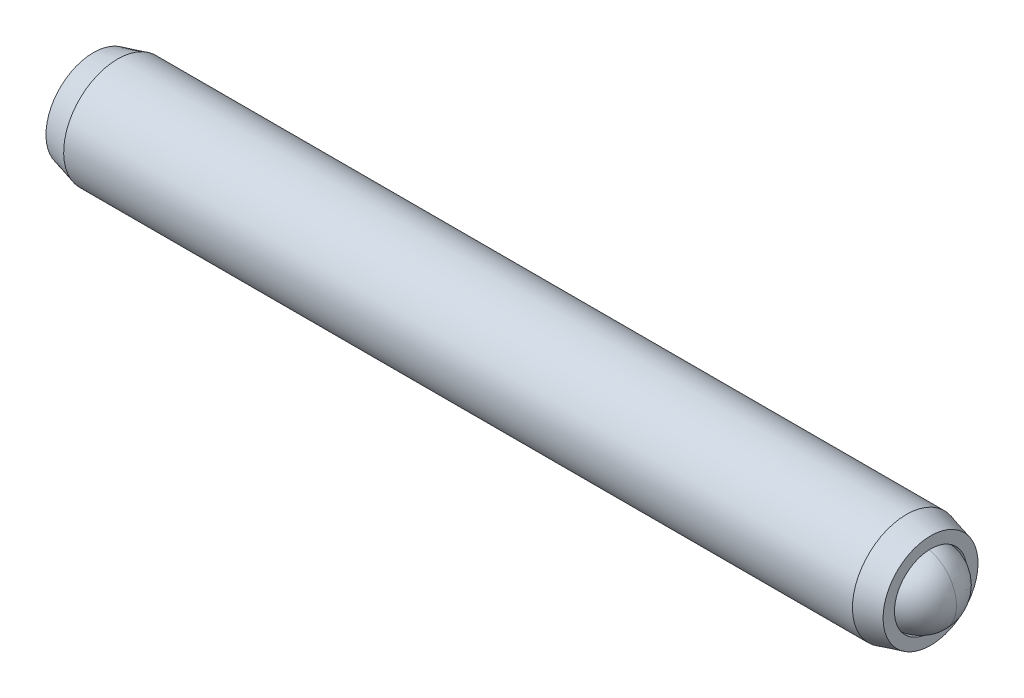
ISO-10303-21;
HEADER;
FILE_DESCRIPTION(('STEP AP214'),'2;1');
FILE_NAME('part.step','',(''),(''),'','','');
FILE_SCHEMA(('AUTOMOTIVE_DESIGN { 1 0 10303 214 1 1 1 1 }'));
ENDSEC;
DATA;
#1=APPLICATION_CONTEXT('core data for automotive mechanical design processes');
#2=APPLICATION_PROTOCOL_DEFINITION('international standard','automotive_design',2000,#1);
#3=PRODUCT_CONTEXT('',#1,'mechanical');
#4=PRODUCT('Part','Part','',(#3));
#5=PRODUCT_RELATED_PRODUCT_CATEGORY('part','',(#4));
#6=PRODUCT_DEFINITION_FORMATION('','',#4);
#7=PRODUCT_DEFINITION_CONTEXT('part definition',#1,'design');
#8=PRODUCT_DEFINITION('design','',#6,#7);
#9=PRODUCT_DEFINITION_SHAPE('','',#8);
#10=(LENGTH_UNIT() NAMED_UNIT(*) SI_UNIT(.MILLI.,.METRE.));
#11=(NAMED_UNIT(*) PLANE_ANGLE_UNIT() SI_UNIT($,.RADIAN.));
#12=(NAMED_UNIT(*) SI_UNIT($,.STERADIAN.) SOLID_ANGLE_UNIT());
#13=UNCERTAINTY_MEASURE_WITH_UNIT(LENGTH_MEASURE(1.E-05),#10,'distance_accuracy_value','');
#14=(GEOMETRIC_REPRESENTATION_CONTEXT(3) GLOBAL_UNCERTAINTY_ASSIGNED_CONTEXT((#13)) GLOBAL_UNIT_ASSIGNED_CONTEXT((#10,
#11,#12)) REPRESENTATION_CONTEXT('',''));
#15=CARTESIAN_POINT('',(0.,0.,0.));
#16=DIRECTION('',(0.,0.,1.));
#17=DIRECTION('',(1.,0.,0.));
#18=AXIS2_PLACEMENT_3D('',#15,#16,#17);
#19=CARTESIAN_POINT('',(-35.5952580819999,9.11150092372431,3.86220416332089));
#20=DIRECTION('',(-1.,0.,0.));
#21=DIRECTION('',(0.,-1.,0.));
#22=AXIS2_PLACEMENT_3D('',#19,#20,#21);
#23=PLANE('',#22);
#24=DIRECTION('',(0.,0.866025403784439,-0.5));
#25=VECTOR('',#24,1.);
#26=CARTESIAN_POINT('',(-35.5952580819999,8.9845009237243,2.49655427033648));
#27=LINE('',#26,#25);
#28=CARTESIAN_POINT('',(-35.5952580819999,7.8653134237243,3.14271747473515));
#29=VERTEX_POINT('',#28);
#30=CARTESIAN_POINT('',(-35.5952580819999,9.1115009237243,2.4232307861494));
#31=VERTEX_POINT('',#30);
#32=EDGE_CURVE('P0_E163',#29,#31,#27,.T.);
#33=ORIENTED_EDGE('',*,*,#32,.T.);
#34=DIRECTION('',(0.,0.866025403784439,0.5));
#35=VECTOR('',#34,1.);
#36=CARTESIAN_POINT('',(-35.5952580819999,10.2306884237243,3.06939399054806));
#37=LINE('',#36,#35);
#38=CARTESIAN_POINT('',(-35.5952580819999,10.3576884237243,3.14271747473515));
#39=VERTEX_POINT('',#38);
#40=EDGE_CURVE('P0_E165',#31,#39,#37,.T.);
#41=ORIENTED_EDGE('',*,*,#40,.T.);
#42=DIRECTION('',(0.,0.,1.));
#43=VECTOR('',#42,1.);
#44=CARTESIAN_POINT('',(-35.5952580819999,10.3576884237243,4.43504388353248));
#45=LINE('',#44,#43);
#46=CARTESIAN_POINT('',(-35.5952580819999,10.3576884237243,4.58169085190664));
#47=VERTEX_POINT('',#46);
#48=EDGE_CURVE('P0_E155',#39,#47,#45,.T.);
#49=ORIENTED_EDGE('',*,*,#48,.T.);
#50=DIRECTION('',(0.,-0.866025403784439,0.5));
#51=VECTOR('',#50,1.);
#52=CARTESIAN_POINT('',(-35.5952580819999,9.2385009237243,5.22785405630531));
#53=LINE('',#52,#51);
#54=CARTESIAN_POINT('',(-35.5952580819999,9.1115009237243,5.30117754049239));
#55=VERTEX_POINT('',#54);
#56=EDGE_CURVE('P0_E157',#47,#55,#53,.T.);
#57=ORIENTED_EDGE('',*,*,#56,.T.);
#58=DIRECTION('',(0.,-0.866025403784439,-0.5));
#59=VECTOR('',#58,1.);
#60=CARTESIAN_POINT('',(-35.5952580819999,7.9923134237243,4.65501433609372));
#61=LINE('',#60,#59);
#62=CARTESIAN_POINT('',(-35.5952580819999,7.8653134237243,4.58169085190664));
#63=VERTEX_POINT('',#62);
#64=EDGE_CURVE('P0_E159',#55,#63,#61,.T.);
#65=ORIENTED_EDGE('',*,*,#64,.T.);
#66=DIRECTION('',(0.,0.,-1.));
#67=VECTOR('',#66,1.);
#68=CARTESIAN_POINT('',(-35.5952580819999,7.8653134237243,3.28936444310931));
#69=LINE('',#68,#67);
#70=EDGE_CURVE('P0_E161',#63,#29,#69,.T.);
#71=ORIENTED_EDGE('',*,*,#70,.T.);
#72=EDGE_LOOP('',(#33,#41,#49,#57,#65,#71));
#73=FACE_BOUND('',#72,.T.);
#74=CARTESIAN_POINT('',(-35.5952580819999,9.11150092372431,3.86220416332089));
#75=DIRECTION('',(1.,0.,0.));
#76=DIRECTION('',(0.,1.,0.));
#77=AXIS2_PLACEMENT_3D('',#74,#75,#76);
#78=CIRCLE('',#77,2.0955);
#79=CARTESIAN_POINT('',(-35.5952580819999,11.2070009237243,3.86220416332089));
#80=VERTEX_POINT('',#79);
#81=EDGE_CURVE('P0_E149',#80,#80,#78,.T.);
#82=ORIENTED_EDGE('',*,*,#81,.F.);
#83=EDGE_LOOP('',(#82));
#84=FACE_BOUND('',#83,.T.);
#85=ADVANCED_FACE('P0_F16',(#73,#84),#23,.T.);
#86=CARTESIAN_POINT('',(-34.5288245637371,9.11150092372431,3.86220416332089));
#87=DIRECTION('',(1.,0.,0.));
#88=DIRECTION('',(0.,1.,0.));
#89=AXIS2_PLACEMENT_3D('',#86,#87,#88);
#90=CONICAL_SURFACE('',#89,2.38125,0.261799387799149);
#91=ORIENTED_EDGE('',*,*,#81,.T.);
#92=EDGE_LOOP('',(#91));
#93=FACE_BOUND('',#92,.T.);
#94=CARTESIAN_POINT('',(-34.5288245637371,9.11150092372431,3.86220416332089));
#95=DIRECTION('',(1.,0.,0.));
#96=DIRECTION('',(0.,1.,0.));
#97=AXIS2_PLACEMENT_3D('',#94,#95,#96);
#98=CIRCLE('',#97,2.38125);
#99=CARTESIAN_POINT('',(-34.5288245637371,11.4927509237243,3.86220416332089));
#100=VERTEX_POINT('',#99);
#101=EDGE_CURVE('P0_E146',#100,#100,#98,.T.);
#102=ORIENTED_EDGE('',*,*,#101,.F.);
#103=EDGE_LOOP('',(#102));
#104=FACE_BOUND('',#103,.T.);
#105=ADVANCED_FACE('P0_F224',(#93,#104),#90,.T.);
#106=CARTESIAN_POINT('',(-1.32782211226718,9.11150092372431,3.86220416332089));
#107=DIRECTION('',(1.,0.,0.));
#108=DIRECTION('',(0.,1.,0.));
#109=AXIS2_PLACEMENT_3D('',#106,#107,#108);
#110=CYLINDRICAL_SURFACE('',#109,2.38125);
#111=ORIENTED_EDGE('',*,*,#101,.T.);
#112=EDGE_LOOP('',(#111));
#113=FACE_BOUND('',#112,.T.);
#114=CARTESIAN_POINT('',(0.2953083997373,9.11150092372431,3.86220416332089));
#115=DIRECTION('',(1.,0.,0.));
#116=DIRECTION('',(0.,1.,0.));
#117=AXIS2_PLACEMENT_3D('',#114,#115,#116);
#118=CIRCLE('',#117,2.38125);
#119=CARTESIAN_POINT('',(0.2953083997373,11.4927509237243,3.86220416332089));
#120=VERTEX_POINT('',#119);
#121=EDGE_CURVE('P0_E143',#120,#120,#118,.T.);
#122=ORIENTED_EDGE('',*,*,#121,.F.);
#123=EDGE_LOOP('',(#122));
#124=FACE_BOUND('',#123,.T.);
#125=ADVANCED_FACE('P0_F230',(#113,#124),#110,.T.);
#126=CARTESIAN_POINT('',(1.3617419180001,9.11150092372431,3.86220416332089));
#127=DIRECTION('',(-1.,0.,0.));
#128=DIRECTION('',(0.,-1.,0.));
#129=AXIS2_PLACEMENT_3D('',#126,#127,#128);
#130=CONICAL_SURFACE('',#129,2.0955,0.26179938779915);
#131=ORIENTED_EDGE('',*,*,#121,.T.);
#132=EDGE_LOOP('',(#131));
#133=FACE_BOUND('',#132,.T.);
#134=CARTESIAN_POINT('',(1.3617419180001,9.11150092372431,3.86220416332089));
#135=DIRECTION('',(1.,0.,0.));
#136=DIRECTION('',(0.,1.,0.));
#137=AXIS2_PLACEMENT_3D('',#134,#135,#136);
#138=CIRCLE('',#137,2.0955);
#139=CARTESIAN_POINT('',(1.3617419180001,11.2070009237243,3.86220416332089));
#140=VERTEX_POINT('',#139);
#141=EDGE_CURVE('P0_E140',#140,#140,#138,.T.);
#142=ORIENTED_EDGE('',*,*,#141,.F.);
#143=EDGE_LOOP('',(#142));
#144=FACE_BOUND('',#143,.T.);
#145=ADVANCED_FACE('P0_F274',(#133,#144),#130,.T.);
#146=CARTESIAN_POINT('',(1.3617419180001,11.2070009237243,3.86220416332089));
#147=DIRECTION('',(1.,0.,0.));
#148=DIRECTION('',(0.,1.,0.));
#149=AXIS2_PLACEMENT_3D('',#146,#147,#148);
#150=PLANE('',#149);
#151=ORIENTED_EDGE('',*,*,#141,.T.);
#152=EDGE_LOOP('',(#151));
#153=FACE_BOUND('',#152,.T.);
#154=CARTESIAN_POINT('',(1.3617419180001,9.11150092372431,3.86220416332089));
#155=DIRECTION('',(1.,0.,0.));
#156=DIRECTION('',(0.,1.,0.));
#157=AXIS2_PLACEMENT_3D('',#154,#155,#156);
#158=CIRCLE('',#157,1.59385);
#159=CARTESIAN_POINT('',(1.3617419180001,10.7053509237243,3.86220416332089));
#160=VERTEX_POINT('',#159);
#161=EDGE_CURVE('P0_E137',#160,#160,#158,.T.);
#162=ORIENTED_EDGE('',*,*,#161,.F.);
#163=EDGE_LOOP('',(#162));
#164=FACE_BOUND('',#163,.T.);
#165=ADVANCED_FACE('P0_F270',(#153,#164),#150,.T.);
#166=CARTESIAN_POINT('',(-1.32782211226718,9.11150092372431,3.86220416332089));
#167=DIRECTION('',(1.,0.,0.));
#168=DIRECTION('',(0.,1.,0.));
#169=AXIS2_PLACEMENT_3D('',#166,#167,#168);
#170=CYLINDRICAL_SURFACE('',#169,1.59385);
#171=ORIENTED_EDGE('',*,*,#161,.T.);
#172=EDGE_LOOP('',(#171));
#173=FACE_BOUND('',#172,.T.);
#174=CARTESIAN_POINT('',(0.266027887732813,9.11150092372431,3.86220416332089));
#175=DIRECTION('',(1.,0.,0.));
#176=DIRECTION('',(0.,1.,0.));
#177=AXIS2_PLACEMENT_3D('',#174,#175,#176);
#178=CIRCLE('',#177,1.59385);
#179=CARTESIAN_POINT('',(0.266027887732813,10.7053509237243,3.86220416332089));
#180=VERTEX_POINT('',#179);
#181=EDGE_CURVE('P0_E125',#180,#180,#178,.T.);
#182=ORIENTED_EDGE('',*,*,#181,.F.);
#183=EDGE_LOOP('',(#182));
#184=FACE_BOUND('',#183,.T.);
#185=ADVANCED_FACE('P0_F266',(#173,#184),#170,.F.);
#186=CARTESIAN_POINT('',(-1.32782211226718,9.11150092372431,3.86220416332089));
#187=DIRECTION('',(1.,0.,0.));
#188=DIRECTION('',(0.,1.,0.));
#189=AXIS2_PLACEMENT_3D('',#186,#187,#188);
#190=CONICAL_SURFACE('',#189,0.,0.78539816339745);
#191=ORIENTED_EDGE('',*,*,#181,.T.);
#192=EDGE_LOOP('',(#191));
#193=FACE_BOUND('',#192,.T.);
#194=CARTESIAN_POINT('',(-1.32782211226718,9.11150092372431,3.86220416332089));
#195=VERTEX_POINT('',#194);
#196=VERTEX_LOOP('',#195);
#197=FACE_BOUND('',#196,.T.);
#198=ADVANCED_FACE('P0_F220',(#193,#197),#190,.F.);
#199=CARTESIAN_POINT('',(-32.5472580819999,9.1115009237243,5.00788360374406));
#200=DIRECTION('',(0.,0.5,0.866025403784439));
#201=DIRECTION('',(0.,-0.866025403784439,0.5));
#202=AXIS2_PLACEMENT_3D('',#199,#200,#201);
#203=PLANE('',#202);
#204=DIRECTION('',(-1.,0.,0.));
#205=VECTOR('',#204,1.);
#206=CARTESIAN_POINT('',(-32.5472580819999,9.1115009237243,5.00788360374406));
#207=LINE('',#206,#205);
#208=CARTESIAN_POINT('',(-32.5472580819999,9.1115009237243,5.00788360374406));
#209=VERTEX_POINT('',#208);
#210=CARTESIAN_POINT('',(-35.3412580819999,9.1115009237243,5.00788360374406));
#211=VERTEX_POINT('',#210);
#212=EDGE_CURVE('P0_E123',#209,#211,#207,.T.);
#213=ORIENTED_EDGE('',*,*,#212,.T.);
#214=DIRECTION('',(0.,0.866025403784439,-0.5));
#215=VECTOR('',#214,1.);
#216=CARTESIAN_POINT('',(-35.3412580819999,10.1036884237243,4.43504388353248));
#217=LINE('',#216,#215);
#218=CARTESIAN_POINT('',(-35.3412580819999,10.1036884237243,4.43504388353248));
#219=VERTEX_POINT('',#218);
#220=EDGE_CURVE('P0_E25',#211,#219,#217,.T.);
#221=ORIENTED_EDGE('',*,*,#220,.T.);
#222=DIRECTION('',(-1.,0.,0.));
#223=VECTOR('',#222,1.);
#224=CARTESIAN_POINT('',(-32.5472580819999,10.1036884237243,4.43504388353248));
#225=LINE('',#224,#223);
#226=CARTESIAN_POINT('',(-32.5472580819999,10.1036884237243,4.43504388353248));
#227=VERTEX_POINT('',#226);
#228=EDGE_CURVE('P0_E89',#227,#219,#225,.T.);
#229=ORIENTED_EDGE('',*,*,#228,.F.);
#230=DIRECTION('',(0.,0.866025403784439,-0.5));
#231=VECTOR('',#230,1.);
#232=CARTESIAN_POINT('',(-32.5472580819999,9.1115009237243,5.00788360374406));
#233=LINE('',#232,#231);
#234=EDGE_CURVE('P0_E93',#209,#227,#233,.T.);
#235=ORIENTED_EDGE('',*,*,#234,.F.);
#236=EDGE_LOOP('',(#213,#221,#229,#235));
#237=FACE_BOUND('',#236,.T.);
#238=ADVANCED_FACE('P0_F91',(#237),#203,.F.);
#239=CARTESIAN_POINT('',(-32.5472580819999,8.1193134237243,4.43504388353248));
#240=DIRECTION('',(0.,-0.5,0.866025403784439));
#241=DIRECTION('',(0.,-0.866025403784439,-0.5));
#242=AXIS2_PLACEMENT_3D('',#239,#240,#241);
#243=PLANE('',#242);
#244=DIRECTION('',(-1.,0.,0.));
#245=VECTOR('',#244,1.);
#246=CARTESIAN_POINT('',(-32.5472580819999,8.1193134237243,4.43504388353248));
#247=LINE('',#246,#245);
#248=CARTESIAN_POINT('',(-32.5472580819999,8.1193134237243,4.43504388353248));
#249=VERTEX_POINT('',#248);
#250=CARTESIAN_POINT('',(-35.3412580819999,8.1193134237243,4.43504388353248));
#251=VERTEX_POINT('',#250);
#252=EDGE_CURVE('P0_E126',#249,#251,#247,.T.);
#253=ORIENTED_EDGE('',*,*,#252,.T.);
#254=DIRECTION('',(0.,0.866025403784439,0.5));
#255=VECTOR('',#254,1.);
#256=CARTESIAN_POINT('',(-35.3412580819999,9.1115009237243,5.00788360374406));
#257=LINE('',#256,#255);
#258=EDGE_CURVE('P0_E40',#251,#211,#257,.T.);
#259=ORIENTED_EDGE('',*,*,#258,.T.);
#260=ORIENTED_EDGE('',*,*,#212,.F.);
#261=DIRECTION('',(0.,0.866025403784439,0.5));
#262=VECTOR('',#261,1.);
#263=CARTESIAN_POINT('',(-32.5472580819999,8.1193134237243,4.43504388353248));
#264=LINE('',#263,#262);
#265=EDGE_CURVE('P0_E98',#249,#209,#264,.T.);
#266=ORIENTED_EDGE('',*,*,#265,.F.);
#267=EDGE_LOOP('',(#253,#259,#260,#266));
#268=FACE_BOUND('',#267,.T.);
#269=ADVANCED_FACE('P0_F211',(#268),#243,.F.);
#270=CARTESIAN_POINT('',(-32.5472580819999,8.1193134237243,3.28936444310931));
#271=DIRECTION('',(0.,-1.,0.));
#272=DIRECTION('',(0.,0.,-1.));
#273=AXIS2_PLACEMENT_3D('',#270,#271,#272);
#274=PLANE('',#273);
#275=DIRECTION('',(-1.,0.,0.));
#276=VECTOR('',#275,1.);
#277=CARTESIAN_POINT('',(-32.5472580819999,8.1193134237243,3.28936444310931));
#278=LINE('',#277,#276);
#279=CARTESIAN_POINT('',(-32.5472580819999,8.1193134237243,3.28936444310931));
#280=VERTEX_POINT('',#279);
#281=CARTESIAN_POINT('',(-35.3412580819999,8.1193134237243,3.28936444310931));
#282=VERTEX_POINT('',#281);
#283=EDGE_CURVE('P0_E128',#280,#282,#278,.T.);
#284=ORIENTED_EDGE('',*,*,#283,.T.);
#285=DIRECTION('',(0.,0.,1.));
#286=VECTOR('',#285,1.);
#287=CARTESIAN_POINT('',(-35.3412580819999,8.1193134237243,4.43504388353248));
#288=LINE('',#287,#286);
#289=EDGE_CURVE('P0_E170',#282,#251,#288,.T.);
#290=ORIENTED_EDGE('',*,*,#289,.T.);
#291=ORIENTED_EDGE('',*,*,#252,.F.);
#292=DIRECTION('',(0.,0.,1.));
#293=VECTOR('',#292,1.);
#294=CARTESIAN_POINT('',(-32.5472580819999,8.1193134237243,3.28936444310931));
#295=LINE('',#294,#293);
#296=EDGE_CURVE('P0_E120',#280,#249,#295,.T.);
#297=ORIENTED_EDGE('',*,*,#296,.F.);
#298=EDGE_LOOP('',(#284,#290,#291,#297));
#299=FACE_BOUND('',#298,.T.);
#300=ADVANCED_FACE('P0_F210',(#299),#274,.F.);
#301=CARTESIAN_POINT('',(-32.5472580819999,9.1115009237243,2.71652472289773));
#302=DIRECTION('',(0.,-0.5,-0.866025403784439));
#303=DIRECTION('',(0.,0.866025403784439,-0.5));
#304=AXIS2_PLACEMENT_3D('',#301,#302,#303);
#305=PLANE('',#304);
#306=DIRECTION('',(-1.,0.,0.));
#307=VECTOR('',#306,1.);
#308=CARTESIAN_POINT('',(-32.5472580819999,9.1115009237243,2.71652472289773));
#309=LINE('',#308,#307);
#310=CARTESIAN_POINT('',(-32.5472580819999,9.1115009237243,2.71652472289773));
#311=VERTEX_POINT('',#310);
#312=CARTESIAN_POINT('',(-35.3412580819999,9.1115009237243,2.71652472289773));
#313=VERTEX_POINT('',#312);
#314=EDGE_CURVE('P0_E131',#311,#313,#309,.T.);
#315=ORIENTED_EDGE('',*,*,#314,.T.);
#316=DIRECTION('',(0.,-0.866025403784439,0.5));
#317=VECTOR('',#316,1.);
#318=CARTESIAN_POINT('',(-35.3412580819999,8.1193134237243,3.28936444310931));
#319=LINE('',#318,#317);
#320=EDGE_CURVE('P0_E168',#313,#282,#319,.T.);
#321=ORIENTED_EDGE('',*,*,#320,.T.);
#322=ORIENTED_EDGE('',*,*,#283,.F.);
#323=DIRECTION('',(0.,-0.866025403784439,0.5));
#324=VECTOR('',#323,1.);
#325=CARTESIAN_POINT('',(-32.5472580819999,9.1115009237243,2.71652472289773));
#326=LINE('',#325,#324);
#327=EDGE_CURVE('P0_E117',#311,#280,#326,.T.);
#328=ORIENTED_EDGE('',*,*,#327,.F.);
#329=EDGE_LOOP('',(#315,#321,#322,#328));
#330=FACE_BOUND('',#329,.T.);
#331=ADVANCED_FACE('P0_F207',(#330),#305,.F.);
#332=CARTESIAN_POINT('',(-32.5472580819999,10.1036884237243,3.28936444310931));
#333=DIRECTION('',(0.,0.5,-0.866025403784439));
#334=DIRECTION('',(0.,0.866025403784439,0.5));
#335=AXIS2_PLACEMENT_3D('',#332,#333,#334);
#336=PLANE('',#335);
#337=DIRECTION('',(-1.,0.,0.));
#338=VECTOR('',#337,1.);
#339=CARTESIAN_POINT('',(-32.5472580819999,10.1036884237243,3.28936444310931));
#340=LINE('',#339,#338);
#341=CARTESIAN_POINT('',(-32.5472580819999,10.1036884237243,3.28936444310931));
#342=VERTEX_POINT('',#341);
#343=CARTESIAN_POINT('',(-35.3412580819999,10.1036884237243,3.28936444310931));
#344=VERTEX_POINT('',#343);
#345=EDGE_CURVE('P0_E97',#342,#344,#340,.T.);
#346=ORIENTED_EDGE('',*,*,#345,.T.);
#347=DIRECTION('',(0.,-0.866025403784439,-0.5));
#348=VECTOR('',#347,1.);
#349=CARTESIAN_POINT('',(-35.3412580819999,9.1115009237243,2.71652472289773));
#350=LINE('',#349,#348);
#351=EDGE_CURVE('P0_E152',#344,#313,#350,.T.);
#352=ORIENTED_EDGE('',*,*,#351,.T.);
#353=ORIENTED_EDGE('',*,*,#314,.F.);
#354=DIRECTION('',(0.,-0.866025403784439,-0.5));
#355=VECTOR('',#354,1.);
#356=CARTESIAN_POINT('',(-32.5472580819999,10.1036884237243,3.28936444310931));
#357=LINE('',#356,#355);
#358=EDGE_CURVE('P0_E107',#342,#311,#357,.T.);
#359=ORIENTED_EDGE('',*,*,#358,.F.);
#360=EDGE_LOOP('',(#346,#352,#353,#359));
#361=FACE_BOUND('',#360,.T.);
#362=ADVANCED_FACE('P0_F203',(#361),#336,.F.);
#363=CARTESIAN_POINT('',(-32.5472580819999,10.1036884237243,4.43504388353248));
#364=DIRECTION('',(0.,1.,0.));
#365=DIRECTION('',(-1.,0.,0.));
#366=AXIS2_PLACEMENT_3D('',#363,#364,#365);
#367=PLANE('',#366);
#368=ORIENTED_EDGE('',*,*,#228,.T.);
#369=DIRECTION('',(0.,0.,-1.));
#370=VECTOR('',#369,1.);
#371=CARTESIAN_POINT('',(-35.3412580819999,10.1036884237243,3.28936444310931));
#372=LINE('',#371,#370);
#373=EDGE_CURVE('P0_E10',#219,#344,#372,.T.);
#374=ORIENTED_EDGE('',*,*,#373,.T.);
#375=ORIENTED_EDGE('',*,*,#345,.F.);
#376=DIRECTION('',(0.,0.,-1.));
#377=VECTOR('',#376,1.);
#378=CARTESIAN_POINT('',(-32.5472580819999,10.1036884237243,4.43504388353248));
#379=LINE('',#378,#377);
#380=EDGE_CURVE('P0_E101',#227,#342,#379,.T.);
#381=ORIENTED_EDGE('',*,*,#380,.F.);
#382=EDGE_LOOP('',(#368,#374,#375,#381));
#383=FACE_BOUND('',#382,.T.);
#384=ADVANCED_FACE('P0_F102',(#383),#367,.F.);
#385=CARTESIAN_POINT('',(-32.5472580819999,9.1115009237243,5.00788360374406));
#386=DIRECTION('',(1.,0.,0.));
#387=DIRECTION('',(0.,0.,-1.));
#388=AXIS2_PLACEMENT_3D('',#385,#386,#387);
#389=PLANE('',#388);
#390=ORIENTED_EDGE('',*,*,#234,.T.);
#391=ORIENTED_EDGE('',*,*,#380,.T.);
#392=ORIENTED_EDGE('',*,*,#358,.T.);
#393=ORIENTED_EDGE('',*,*,#327,.T.);
#394=ORIENTED_EDGE('',*,*,#296,.T.);
#395=ORIENTED_EDGE('',*,*,#265,.T.);
#396=EDGE_LOOP('',(#390,#391,#392,#393,#394,#395));
#397=FACE_BOUND('',#396,.T.);
#398=ADVANCED_FACE('P0_F109',(#397),#389,.F.);
#399=CARTESIAN_POINT('',(-35.3412580819999,8.1193134237243,4.43504388353248));
#400=DIRECTION('',(-0.707106781186548,0.353553390593274,-0.612372435695794));
#401=DIRECTION('',(-0.654653670707977,0.,0.755928946018455));
#402=AXIS2_PLACEMENT_3D('',#399,#400,#401);
#403=PLANE('',#402);
#404=DIRECTION('',(-0.654653670707977,-0.654653670707977,0.377964473009228));
#405=VECTOR('',#404,1.);
#406=CARTESIAN_POINT('',(-35.0577759391428,8.40279556658144,4.27137539204345));
#407=LINE('',#406,#405);
#408=EDGE_CURVE('P0_E114',#63,#251,#407,.F.);
#409=ORIENTED_EDGE('',*,*,#408,.F.);
#410=ORIENTED_EDGE('',*,*,#64,.F.);
#411=DIRECTION('',(-0.654653670707977,0.,0.755928946018455));
#412=VECTOR('',#411,1.);
#413=CARTESIAN_POINT('',(-35.0577759391428,9.1115009237243,4.68054662076601));
#414=LINE('',#413,#412);
#415=EDGE_CURVE('P0_E20',#211,#55,#414,.T.);
#416=ORIENTED_EDGE('',*,*,#415,.F.);
#417=ORIENTED_EDGE('',*,*,#258,.F.);
#418=EDGE_LOOP('',(#409,#410,#416,#417));
#419=FACE_BOUND('',#418,.T.);
#420=ADVANCED_FACE('P0_F18',(#419),#403,.T.);
#421=CARTESIAN_POINT('',(-35.3412580819999,9.1115009237243,5.00788360374406));
#422=DIRECTION('',(-0.707106781186547,-0.353553390593274,-0.612372435695795));
#423=DIRECTION('',(-0.654653670707977,0.,0.755928946018454));
#424=AXIS2_PLACEMENT_3D('',#421,#422,#423);
#425=PLANE('',#424);
#426=ORIENTED_EDGE('',*,*,#415,.T.);
#427=ORIENTED_EDGE('',*,*,#56,.F.);
#428=DIRECTION('',(-0.654653670707977,0.654653670707977,0.377964473009227));
#429=VECTOR('',#428,1.);
#430=CARTESIAN_POINT('',(-35.0577759391428,9.82020628086716,4.27137539204345));
#431=LINE('',#430,#429);
#432=EDGE_CURVE('P0_E181',#219,#47,#431,.T.);
#433=ORIENTED_EDGE('',*,*,#432,.F.);
#434=ORIENTED_EDGE('',*,*,#220,.F.);
#435=EDGE_LOOP('',(#426,#427,#433,#434));
#436=FACE_BOUND('',#435,.T.);
#437=ADVANCED_FACE('P0_F195',(#436),#425,.T.);
#438=CARTESIAN_POINT('',(-35.3412580819999,8.1193134237243,3.28936444310931));
#439=DIRECTION('',(-0.707106781186548,0.707106781186547,0.));
#440=DIRECTION('',(-0.707106781186547,-0.707106781186548,0.));
#441=AXIS2_PLACEMENT_3D('',#438,#439,#440);
#442=PLANE('',#441);
#443=ORIENTED_EDGE('',*,*,#408,.T.);
#444=ORIENTED_EDGE('',*,*,#289,.F.);
#445=DIRECTION('',(-0.654653670707977,-0.654653670707977,-0.377964473009228));
#446=VECTOR('',#445,1.);
#447=CARTESIAN_POINT('',(-35.0577759391428,8.40279556658144,3.45303293459834));
#448=LINE('',#447,#446);
#449=EDGE_CURVE('P0_E178',#29,#282,#448,.F.);
#450=ORIENTED_EDGE('',*,*,#449,.F.);
#451=ORIENTED_EDGE('',*,*,#70,.F.);
#452=EDGE_LOOP('',(#443,#444,#450,#451));
#453=FACE_BOUND('',#452,.T.);
#454=ADVANCED_FACE('P0_F188',(#453),#442,.T.);
#455=CARTESIAN_POINT('',(-35.3412580819999,10.1036884237243,4.43504388353248));
#456=DIRECTION('',(-0.707106781186547,-0.707106781186547,0.));
#457=DIRECTION('',(0.707106781186548,-0.707106781186548,0.));
#458=AXIS2_PLACEMENT_3D('',#455,#456,#457);
#459=PLANE('',#458);
#460=ORIENTED_EDGE('',*,*,#432,.T.);
#461=ORIENTED_EDGE('',*,*,#48,.F.);
#462=DIRECTION('',(0.654653670707977,-0.654653670707977,0.377964473009226));
#463=VECTOR('',#462,1.);
#464=CARTESIAN_POINT('',(-35.3412580819999,10.1036884237243,3.28936444310931));
#465=LINE('',#464,#463);
#466=EDGE_CURVE('P0_E176',#344,#39,#465,.F.);
#467=ORIENTED_EDGE('',*,*,#466,.F.);
#468=ORIENTED_EDGE('',*,*,#373,.F.);
#469=EDGE_LOOP('',(#460,#461,#467,#468));
#470=FACE_BOUND('',#469,.T.);
#471=ADVANCED_FACE('P0_F200',(#470),#459,.T.);
#472=CARTESIAN_POINT('',(-35.3412580819999,9.1115009237243,2.71652472289773));
#473=DIRECTION('',(-0.707106781186548,0.353553390593274,0.612372435695794));
#474=DIRECTION('',(0.654653670707977,0.,0.755928946018455));
#475=AXIS2_PLACEMENT_3D('',#472,#473,#474);
#476=PLANE('',#475);
#477=ORIENTED_EDGE('',*,*,#449,.T.);
#478=ORIENTED_EDGE('',*,*,#320,.F.);
#479=DIRECTION('',(-0.654653670707977,0.,-0.755928946018454));
#480=VECTOR('',#479,1.);
#481=CARTESIAN_POINT('',(-35.0577759391428,9.1115009237243,3.04386170587578));
#482=LINE('',#481,#480);
#483=EDGE_CURVE('P0_E174',#31,#313,#482,.F.);
#484=ORIENTED_EDGE('',*,*,#483,.F.);
#485=ORIENTED_EDGE('',*,*,#32,.F.);
#486=EDGE_LOOP('',(#477,#478,#484,#485));
#487=FACE_BOUND('',#486,.T.);
#488=ADVANCED_FACE('P0_F239',(#487),#476,.T.);
#489=CARTESIAN_POINT('',(-35.3412580819999,10.1036884237243,3.28936444310931));
#490=DIRECTION('',(-0.707106781186547,-0.353553390593274,0.612372435695795));
#491=DIRECTION('',(0.654653670707978,0.,0.755928946018454));
#492=AXIS2_PLACEMENT_3D('',#489,#490,#491);
#493=PLANE('',#492);
#494=ORIENTED_EDGE('',*,*,#466,.T.);
#495=ORIENTED_EDGE('',*,*,#40,.F.);
#496=ORIENTED_EDGE('',*,*,#483,.T.);
#497=ORIENTED_EDGE('',*,*,#351,.F.);
#498=EDGE_LOOP('',(#494,#495,#496,#497));
#499=FACE_BOUND('',#498,.T.);
#500=ADVANCED_FACE('P0_F236',(#499),#493,.T.);
#501=CLOSED_SHELL('',(#85,#105,#125,#145,#165,#185,#198,#238,#269,#300,#331,#362,#384,#398,#420,
#437,#454,#471,#488,#500));
#502=MANIFOLD_SOLID_BREP('P0_B1',#501);
#503=CARTESIAN_POINT('',(0.917241918000087,9.11150092372429,3.8622041633209));
#504=DIRECTION('',(0.,1.,0.));
#505=DIRECTION('',(1.,0.,0.));
#506=AXIS2_PLACEMENT_3D('',#503,#504,#505);
#507=SPHERICAL_SURFACE('',#506,1.5875);
#508=CARTESIAN_POINT('',(0.917241918000087,9.11150092372429,3.8622041633209));
#509=DIRECTION('',(0.,0.,-1.));
#510=DIRECTION('',(1.,0.,0.));
#511=AXIS2_PLACEMENT_3D('',#508,#509,#510);
#512=CIRCLE('',#511,1.5875);
#513=CARTESIAN_POINT('',(0.917241918000087,7.52400092372429,3.8622041633209));
#514=VERTEX_POINT('',#513);
#515=CARTESIAN_POINT('',(0.917241918000087,10.6990009237243,3.8622041633209));
#516=VERTEX_POINT('',#515);
#517=EDGE_CURVE('P1_E38',#514,#516,#512,.T.);
#518=ORIENTED_EDGE('',*,*,#517,.F.);
#519=CARTESIAN_POINT('',(0.917241918000087,9.11150092372429,3.8622041633209));
#520=DIRECTION('',(-1.,0.,0.));
#521=DIRECTION('',(0.,0.,-1.));
#522=AXIS2_PLACEMENT_3D('',#519,#520,#521);
#523=CIRCLE('',#522,1.5875);
#524=EDGE_CURVE('P1_E11',#514,#516,#523,.T.);
#525=ORIENTED_EDGE('',*,*,#524,.T.);
#526=EDGE_LOOP('',(#518,#525));
#527=FACE_BOUND('',#526,.T.);
#528=ADVANCED_FACE('P1_F17',(#527),#507,.T.);
#529=ORIENTED_EDGE('',*,*,#517,.T.);
#530=CARTESIAN_POINT('',(0.917241918000087,9.11150092372429,3.8622041633209));
#531=DIRECTION('',(-1.,0.,0.));
#532=DIRECTION('',(0.,0.,-1.));
#533=AXIS2_PLACEMENT_3D('',#530,#531,#532);
#534=CIRCLE('',#533,1.5875);
#535=EDGE_CURVE('P1_E24',#516,#514,#534,.T.);
#536=ORIENTED_EDGE('',*,*,#535,.T.);
#537=EDGE_LOOP('',(#529,#536));
#538=FACE_BOUND('',#537,.T.);
#539=ADVANCED_FACE('P1_F37',(#538),#507,.T.);
#540=ORIENTED_EDGE('',*,*,#535,.F.);
#541=EDGE_CURVE('P1_E34',#516,#514,#512,.T.);
#542=ORIENTED_EDGE('',*,*,#541,.T.);
#543=EDGE_LOOP('',(#540,#542));
#544=FACE_BOUND('',#543,.T.);
#545=ADVANCED_FACE('P1_F40',(#544),#507,.T.);
#546=ORIENTED_EDGE('',*,*,#524,.F.);
#547=ORIENTED_EDGE('',*,*,#541,.F.);
#548=EDGE_LOOP('',(#546,#547));
#549=FACE_BOUND('',#548,.T.);
#550=ADVANCED_FACE('P1_F19',(#549),#507,.T.);
#551=CLOSED_SHELL('',(#528,#539,#545,#550));
#552=MANIFOLD_SOLID_BREP('P1_B1',#551);
#553=ADVANCED_BREP_SHAPE_REPRESENTATION('',(#18,#502,#552),#14);
#554=SHAPE_DEFINITION_REPRESENTATION(#9,#553);
ENDSEC;
END-ISO-10303-21;
